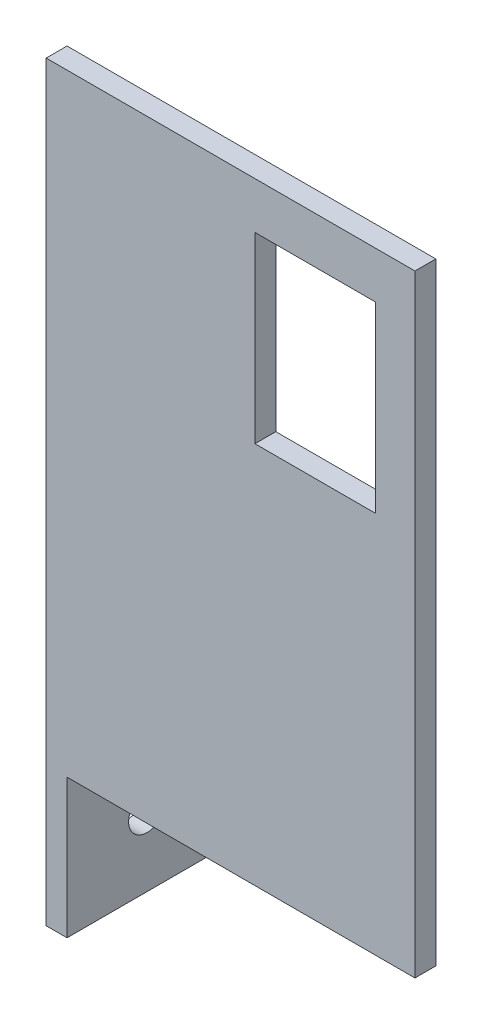
ISO-10303-21;
HEADER;
FILE_DESCRIPTION(('STEP AP214'),'2;1');
FILE_NAME('part.step','',(''),(''),'','','');
FILE_SCHEMA(('AUTOMOTIVE_DESIGN { 1 0 10303 214 1 1 1 1 }'));
ENDSEC;
DATA;
#1=APPLICATION_CONTEXT('core data for automotive mechanical design processes');
#2=APPLICATION_PROTOCOL_DEFINITION('international standard','automotive_design',2000,#1);
#3=PRODUCT_CONTEXT('',#1,'mechanical');
#4=PRODUCT('Part','Part','',(#3));
#5=PRODUCT_RELATED_PRODUCT_CATEGORY('part','',(#4));
#6=PRODUCT_DEFINITION_FORMATION('','',#4);
#7=PRODUCT_DEFINITION_CONTEXT('part definition',#1,'design');
#8=PRODUCT_DEFINITION('design','',#6,#7);
#9=PRODUCT_DEFINITION_SHAPE('','',#8);
#10=(LENGTH_UNIT() NAMED_UNIT(*) SI_UNIT(.MILLI.,.METRE.));
#11=(NAMED_UNIT(*) PLANE_ANGLE_UNIT() SI_UNIT($,.RADIAN.));
#12=(NAMED_UNIT(*) SI_UNIT($,.STERADIAN.) SOLID_ANGLE_UNIT());
#13=UNCERTAINTY_MEASURE_WITH_UNIT(LENGTH_MEASURE(1.E-05),#10,'distance_accuracy_value','');
#14=(GEOMETRIC_REPRESENTATION_CONTEXT(3) GLOBAL_UNCERTAINTY_ASSIGNED_CONTEXT((#13)) GLOBAL_UNIT_ASSIGNED_CONTEXT((#10,
#11,#12)) REPRESENTATION_CONTEXT('',''));
#15=CARTESIAN_POINT('',(0.,0.,0.));
#16=DIRECTION('',(0.,0.,1.));
#17=DIRECTION('',(1.,0.,0.));
#18=AXIS2_PLACEMENT_3D('',#15,#16,#17);
#19=CARTESIAN_POINT('',(8.36363636363636,3.,-11.3770053475936));
#20=DIRECTION('',(-1.,0.,0.));
#21=DIRECTION('',(0.,0.,1.));
#22=AXIS2_PLACEMENT_3D('',#19,#20,#21);
#23=PLANE('',#22);
#24=DIRECTION('',(0.,1.,0.));
#25=VECTOR('',#24,1.);
#26=CARTESIAN_POINT('',(8.36363636363636,88.,8.62299465240642));
#27=LINE('',#26,#25);
#28=CARTESIAN_POINT('',(8.36363636363636,0.,8.62299465240642));
#29=VERTEX_POINT('',#28);
#30=CARTESIAN_POINT('',(8.36363636363636,3.,8.62299465240641));
#31=VERTEX_POINT('',#30);
#32=EDGE_CURVE('E168',#29,#31,#27,.T.);
#33=ORIENTED_EDGE('',*,*,#32,.F.);
#34=DIRECTION('',(0.,0.,-1.));
#35=VECTOR('',#34,1.);
#36=CARTESIAN_POINT('',(8.36363636363636,0.,-11.3770053475936));
#37=LINE('',#36,#35);
#38=CARTESIAN_POINT('',(8.36363636363636,0.,-11.3770053475936));
#39=VERTEX_POINT('',#38);
#40=EDGE_CURVE('E237',#29,#39,#37,.T.);
#41=ORIENTED_EDGE('',*,*,#40,.T.);
#42=DIRECTION('',(0.,-1.,0.));
#43=VECTOR('',#42,1.);
#44=CARTESIAN_POINT('',(8.36363636363636,3.,-11.3770053475936));
#45=LINE('',#44,#43);
#46=CARTESIAN_POINT('',(8.36363636363636,3.,-11.3770053475936));
#47=VERTEX_POINT('',#46);
#48=EDGE_CURVE('E45',#47,#39,#45,.T.);
#49=ORIENTED_EDGE('',*,*,#48,.F.);
#50=DIRECTION('',(0.,0.,-1.));
#51=VECTOR('',#50,1.);
#52=CARTESIAN_POINT('',(8.36363636363636,3.,-11.3770053475936));
#53=LINE('',#52,#51);
#54=EDGE_CURVE('E230',#31,#47,#53,.T.);
#55=ORIENTED_EDGE('',*,*,#54,.F.);
#56=EDGE_LOOP('',(#33,#41,#49,#55));
#57=FACE_BOUND('',#56,.T.);
#58=ADVANCED_FACE('F37',(#57),#23,.F.);
#59=CARTESIAN_POINT('',(0.,0.,0.));
#60=DIRECTION('',(0.,1.,0.));
#61=DIRECTION('',(0.,0.,1.));
#62=AXIS2_PLACEMENT_3D('',#59,#60,#61);
#63=PLANE('',#62);
#64=CARTESIAN_POINT('',(-1.63636363636364,0.,0.122994652406417));
#65=DIRECTION('',(0.,1.,0.));
#66=DIRECTION('',(0.,0.,1.));
#67=AXIS2_PLACEMENT_3D('',#64,#65,#66);
#68=CIRCLE('',#67,2.65);
#69=CARTESIAN_POINT('',(-1.63636363636364,0.,2.77299465240642));
#70=VERTEX_POINT('',#69);
#71=EDGE_CURVE('E222',#70,#70,#68,.T.);
#72=ORIENTED_EDGE('',*,*,#71,.T.);
#73=EDGE_LOOP('',(#72));
#74=FACE_BOUND('',#73,.T.);
#75=DIRECTION('',(0.,0.,1.));
#76=VECTOR('',#75,1.);
#77=CARTESIAN_POINT('',(-11.6363636363636,0.,-11.3770053475936));
#78=LINE('',#77,#76);
#79=CARTESIAN_POINT('',(-11.6363636363636,0.,-11.3770053475936));
#80=VERTEX_POINT('',#79);
#81=CARTESIAN_POINT('',(-11.6363636363636,0.,11.6229946524064));
#82=VERTEX_POINT('',#81);
#83=EDGE_CURVE('E202',#80,#82,#78,.T.);
#84=ORIENTED_EDGE('',*,*,#83,.F.);
#85=DIRECTION('',(-1.,0.,0.));
#86=VECTOR('',#85,1.);
#87=CARTESIAN_POINT('',(-14.6363636363636,0.,-11.3770053475936));
#88=LINE('',#87,#86);
#89=EDGE_CURVE('E231',#39,#80,#88,.T.);
#90=ORIENTED_EDGE('',*,*,#89,.F.);
#91=ORIENTED_EDGE('',*,*,#40,.F.);
#92=DIRECTION('',(-1.,0.,0.));
#93=VECTOR('',#92,1.);
#94=CARTESIAN_POINT('',(38.3636363636364,0.,8.62299465240641));
#95=LINE('',#94,#93);
#96=CARTESIAN_POINT('',(38.3636363636364,0.,8.62299465240641));
#97=VERTEX_POINT('',#96);
#98=EDGE_CURVE('E180',#97,#29,#95,.T.);
#99=ORIENTED_EDGE('',*,*,#98,.F.);
#100=DIRECTION('',(0.,0.,-1.));
#101=VECTOR('',#100,1.);
#102=CARTESIAN_POINT('',(38.3636363636364,0.,8.62299465240641));
#103=LINE('',#102,#101);
#104=CARTESIAN_POINT('',(38.3636363636364,0.,11.6229946524064));
#105=VERTEX_POINT('',#104);
#106=EDGE_CURVE('E178',#105,#97,#103,.T.);
#107=ORIENTED_EDGE('',*,*,#106,.F.);
#108=DIRECTION('',(1.,0.,0.));
#109=VECTOR('',#108,1.);
#110=CARTESIAN_POINT('',(-14.6363636363636,0.,11.6229946524064));
#111=LINE('',#110,#109);
#112=EDGE_CURVE('E225',#82,#105,#111,.T.);
#113=ORIENTED_EDGE('',*,*,#112,.F.);
#114=EDGE_LOOP('',(#84,#90,#91,#99,#107,#113));
#115=FACE_BOUND('',#114,.T.);
#116=ADVANCED_FACE('F253',(#74,#115),#63,.F.);
#117=CARTESIAN_POINT('',(-14.6363636363636,3.,-11.3770053475936));
#118=DIRECTION('',(1.,0.,0.));
#119=DIRECTION('',(0.,0.,-1.));
#120=AXIS2_PLACEMENT_3D('',#117,#118,#119);
#121=PLANE('',#120);
#122=CARTESIAN_POINT('',(-14.6363636363636,-10.,0.122994652406417));
#123=DIRECTION('',(1.,0.,0.));
#124=DIRECTION('',(0.,0.,-1.));
#125=AXIS2_PLACEMENT_3D('',#122,#123,#124);
#126=CIRCLE('',#125,2.65);
#127=CARTESIAN_POINT('',(-14.6363636363636,-10.,-2.52700534759358));
#128=VERTEX_POINT('',#127);
#129=EDGE_CURVE('E199',#128,#128,#126,.T.);
#130=ORIENTED_EDGE('',*,*,#129,.T.);
#131=EDGE_LOOP('',(#130));
#132=FACE_BOUND('',#131,.T.);
#133=DIRECTION('',(0.,-1.,0.));
#134=VECTOR('',#133,1.);
#135=CARTESIAN_POINT('',(-14.6363636363636,3.,-11.3770053475936));
#136=LINE('',#135,#134);
#137=CARTESIAN_POINT('',(-14.6363636363636,3.,-11.3770053475936));
#138=VERTEX_POINT('',#137);
#139=CARTESIAN_POINT('',(-14.6363636363636,-20.,-11.3770053475936));
#140=VERTEX_POINT('',#139);
#141=EDGE_CURVE('E235',#138,#140,#136,.T.);
#142=ORIENTED_EDGE('',*,*,#141,.T.);
#143=DIRECTION('',(0.,0.,-1.));
#144=VECTOR('',#143,1.);
#145=CARTESIAN_POINT('',(-14.6363636363636,-20.,-11.3770053475936));
#146=LINE('',#145,#144);
#147=CARTESIAN_POINT('',(-14.6363636363636,-20.,11.6229946524064));
#148=VERTEX_POINT('',#147);
#149=EDGE_CURVE('E203',#148,#140,#146,.T.);
#150=ORIENTED_EDGE('',*,*,#149,.F.);
#151=DIRECTION('',(0.,-1.,0.));
#152=VECTOR('',#151,1.);
#153=CARTESIAN_POINT('',(-14.6363636363636,3.,11.6229946524064));
#154=LINE('',#153,#152);
#155=CARTESIAN_POINT('',(-14.6363636363636,88.,11.6229946524064));
#156=VERTEX_POINT('',#155);
#157=EDGE_CURVE('E11',#156,#148,#154,.T.);
#158=ORIENTED_EDGE('',*,*,#157,.F.);
#159=DIRECTION('',(0.,0.,1.));
#160=VECTOR('',#159,1.);
#161=CARTESIAN_POINT('',(-14.6363636363636,88.,11.6229946524064));
#162=LINE('',#161,#160);
#163=CARTESIAN_POINT('',(-14.6363636363636,88.,8.62299465240642));
#164=VERTEX_POINT('',#163);
#165=EDGE_CURVE('E184',#164,#156,#162,.T.);
#166=ORIENTED_EDGE('',*,*,#165,.F.);
#167=DIRECTION('',(0.,-1.,0.));
#168=VECTOR('',#167,1.);
#169=CARTESIAN_POINT('',(-14.6363636363636,88.,8.62299465240642));
#170=LINE('',#169,#168);
#171=CARTESIAN_POINT('',(-14.6363636363636,3.,8.62299465240642));
#172=VERTEX_POINT('',#171);
#173=EDGE_CURVE('E191',#164,#172,#170,.T.);
#174=ORIENTED_EDGE('',*,*,#173,.T.);
#175=DIRECTION('',(0.,0.,1.));
#176=VECTOR('',#175,1.);
#177=CARTESIAN_POINT('',(-14.6363636363636,3.,-11.3770053475936));
#178=LINE('',#177,#176);
#179=EDGE_CURVE('E228',#138,#172,#178,.T.);
#180=ORIENTED_EDGE('',*,*,#179,.F.);
#181=EDGE_LOOP('',(#142,#150,#158,#166,#174,#180));
#182=FACE_BOUND('',#181,.T.);
#183=ADVANCED_FACE('F39',(#132,#182),#121,.F.);
#184=CARTESIAN_POINT('',(-14.6363636363636,3.,11.6229946524064));
#185=DIRECTION('',(0.,0.,-1.));
#186=DIRECTION('',(-1.,0.,0.));
#187=AXIS2_PLACEMENT_3D('',#184,#185,#186);
#188=PLANE('',#187);
#189=DIRECTION('',(-1.,0.,0.));
#190=VECTOR('',#189,1.);
#191=CARTESIAN_POINT('',(-14.6363636363636,55.,11.6229946524064));
#192=LINE('',#191,#190);
#193=CARTESIAN_POINT('',(32.6636363636364,55.,11.6229946524064));
#194=VERTEX_POINT('',#193);
#195=CARTESIAN_POINT('',(15.3636363636364,55.,11.6229946524064));
#196=VERTEX_POINT('',#195);
#197=EDGE_CURVE('E162',#194,#196,#192,.T.);
#198=ORIENTED_EDGE('',*,*,#197,.T.);
#199=DIRECTION('',(0.,1.,0.));
#200=VECTOR('',#199,1.);
#201=CARTESIAN_POINT('',(15.3636363636364,3.,11.6229946524064));
#202=LINE('',#201,#200);
#203=CARTESIAN_POINT('',(15.3636363636364,81.3,11.6229946524064));
#204=VERTEX_POINT('',#203);
#205=EDGE_CURVE('E165',#196,#204,#202,.T.);
#206=ORIENTED_EDGE('',*,*,#205,.T.);
#207=DIRECTION('',(1.,0.,0.));
#208=VECTOR('',#207,1.);
#209=CARTESIAN_POINT('',(-14.6363636363636,81.3,11.6229946524064));
#210=LINE('',#209,#208);
#211=CARTESIAN_POINT('',(32.6636363636363,81.3,11.6229946524064));
#212=VERTEX_POINT('',#211);
#213=EDGE_CURVE('E157',#204,#212,#210,.T.);
#214=ORIENTED_EDGE('',*,*,#213,.T.);
#215=DIRECTION('',(0.,-1.,0.));
#216=VECTOR('',#215,1.);
#217=CARTESIAN_POINT('',(32.6636363636363,3.,11.6229946524064));
#218=LINE('',#217,#216);
#219=EDGE_CURVE('E137',#212,#194,#218,.T.);
#220=ORIENTED_EDGE('',*,*,#219,.T.);
#221=EDGE_LOOP('',(#198,#206,#214,#220));
#222=FACE_BOUND('',#221,.T.);
#223=ORIENTED_EDGE('',*,*,#157,.T.);
#224=DIRECTION('',(-1.,0.,0.));
#225=VECTOR('',#224,1.);
#226=CARTESIAN_POINT('',(-14.6363636363636,-20.,11.6229946524064));
#227=LINE('',#226,#225);
#228=CARTESIAN_POINT('',(-11.6363636363636,-20.,11.6229946524064));
#229=VERTEX_POINT('',#228);
#230=EDGE_CURVE('E210',#229,#148,#227,.T.);
#231=ORIENTED_EDGE('',*,*,#230,.F.);
#232=DIRECTION('',(0.,1.,0.));
#233=VECTOR('',#232,1.);
#234=CARTESIAN_POINT('',(-11.6363636363636,-20.,11.6229946524064));
#235=LINE('',#234,#233);
#236=EDGE_CURVE('E213',#229,#82,#235,.T.);
#237=ORIENTED_EDGE('',*,*,#236,.T.);
#238=ORIENTED_EDGE('',*,*,#112,.T.);
#239=DIRECTION('',(0.,-1.,0.));
#240=VECTOR('',#239,1.);
#241=CARTESIAN_POINT('',(38.3636363636364,88.,11.6229946524064));
#242=LINE('',#241,#240);
#243=CARTESIAN_POINT('',(38.3636363636364,88.,11.6229946524064));
#244=VERTEX_POINT('',#243);
#245=EDGE_CURVE('E175',#244,#105,#242,.T.);
#246=ORIENTED_EDGE('',*,*,#245,.F.);
#247=DIRECTION('',(1.,0.,0.));
#248=VECTOR('',#247,1.);
#249=CARTESIAN_POINT('',(-14.6363636363636,88.,11.6229946524064));
#250=LINE('',#249,#248);
#251=EDGE_CURVE('E187',#156,#244,#250,.T.);
#252=ORIENTED_EDGE('',*,*,#251,.F.);
#253=EDGE_LOOP('',(#223,#231,#237,#238,#246,#252));
#254=FACE_BOUND('',#253,.T.);
#255=ADVANCED_FACE('F262',(#222,#254),#188,.F.);
#256=CARTESIAN_POINT('',(-14.6363636363636,3.,-11.3770053475936));
#257=DIRECTION('',(0.,0.,1.));
#258=DIRECTION('',(1.,0.,0.));
#259=AXIS2_PLACEMENT_3D('',#256,#257,#258);
#260=PLANE('',#259);
#261=ORIENTED_EDGE('',*,*,#89,.T.);
#262=DIRECTION('',(0.,1.,0.));
#263=VECTOR('',#262,1.);
#264=CARTESIAN_POINT('',(-11.6363636363636,-20.,-11.3770053475936));
#265=LINE('',#264,#263);
#266=CARTESIAN_POINT('',(-11.6363636363636,-20.,-11.3770053475936));
#267=VERTEX_POINT('',#266);
#268=EDGE_CURVE('E218',#267,#80,#265,.T.);
#269=ORIENTED_EDGE('',*,*,#268,.F.);
#270=DIRECTION('',(1.,0.,0.));
#271=VECTOR('',#270,1.);
#272=CARTESIAN_POINT('',(-14.6363636363636,-20.,-11.3770053475936));
#273=LINE('',#272,#271);
#274=EDGE_CURVE('E206',#140,#267,#273,.T.);
#275=ORIENTED_EDGE('',*,*,#274,.F.);
#276=ORIENTED_EDGE('',*,*,#141,.F.);
#277=DIRECTION('',(-1.,0.,0.));
#278=VECTOR('',#277,1.);
#279=CARTESIAN_POINT('',(-14.6363636363636,3.,-11.3770053475936));
#280=LINE('',#279,#278);
#281=EDGE_CURVE('E233',#47,#138,#280,.T.);
#282=ORIENTED_EDGE('',*,*,#281,.F.);
#283=ORIENTED_EDGE('',*,*,#48,.T.);
#284=EDGE_LOOP('',(#261,#269,#275,#276,#282,#283));
#285=FACE_BOUND('',#284,.T.);
#286=ADVANCED_FACE('F246',(#285),#260,.F.);
#287=CARTESIAN_POINT('',(0.,3.,0.));
#288=DIRECTION('',(0.,1.,0.));
#289=DIRECTION('',(0.,0.,1.));
#290=AXIS2_PLACEMENT_3D('',#287,#288,#289);
#291=PLANE('',#290);
#292=DIRECTION('',(-1.,0.,0.));
#293=VECTOR('',#292,1.);
#294=CARTESIAN_POINT('',(-14.6363636363636,3.,8.62299465240642));
#295=LINE('',#294,#293);
#296=EDGE_CURVE('E183',#31,#172,#295,.T.);
#297=ORIENTED_EDGE('',*,*,#296,.F.);
#298=ORIENTED_EDGE('',*,*,#54,.T.);
#299=ORIENTED_EDGE('',*,*,#281,.T.);
#300=ORIENTED_EDGE('',*,*,#179,.T.);
#301=EDGE_LOOP('',(#297,#298,#299,#300));
#302=FACE_BOUND('',#301,.T.);
#303=CARTESIAN_POINT('',(-1.63636363636364,3.,0.122994652406417));
#304=DIRECTION('',(0.,1.,0.));
#305=DIRECTION('',(0.,0.,1.));
#306=AXIS2_PLACEMENT_3D('',#303,#304,#305);
#307=CIRCLE('',#306,2.65);
#308=CARTESIAN_POINT('',(-1.63636363636364,3.,2.77299465240642));
#309=VERTEX_POINT('',#308);
#310=EDGE_CURVE('E221',#309,#309,#307,.T.);
#311=ORIENTED_EDGE('',*,*,#310,.F.);
#312=EDGE_LOOP('',(#311));
#313=FACE_BOUND('',#312,.T.);
#314=ADVANCED_FACE('F275',(#302,#313),#291,.T.);
#315=CARTESIAN_POINT('',(-1.63636363636364,0.,0.122994652406417));
#316=DIRECTION('',(0.,1.,0.));
#317=DIRECTION('',(0.,0.,1.));
#318=AXIS2_PLACEMENT_3D('',#315,#316,#317);
#319=CYLINDRICAL_SURFACE('',#318,2.65);
#320=ORIENTED_EDGE('',*,*,#71,.F.);
#321=EDGE_LOOP('',(#320));
#322=FACE_BOUND('',#321,.T.);
#323=ORIENTED_EDGE('',*,*,#310,.T.);
#324=EDGE_LOOP('',(#323));
#325=FACE_BOUND('',#324,.T.);
#326=ADVANCED_FACE('F325',(#322,#325),#319,.F.);
#327=CARTESIAN_POINT('',(-11.6363636363636,-20.,-11.3770053475936));
#328=DIRECTION('',(-1.,0.,0.));
#329=DIRECTION('',(0.,0.,1.));
#330=AXIS2_PLACEMENT_3D('',#327,#328,#329);
#331=PLANE('',#330);
#332=CARTESIAN_POINT('',(-11.6363636363636,-10.,0.122994652406417));
#333=DIRECTION('',(1.,0.,0.));
#334=DIRECTION('',(0.,0.,-1.));
#335=AXIS2_PLACEMENT_3D('',#332,#333,#334);
#336=CIRCLE('',#335,2.65);
#337=CARTESIAN_POINT('',(-11.6363636363636,-10.,-2.52700534759358));
#338=VERTEX_POINT('',#337);
#339=EDGE_CURVE('E196',#338,#338,#336,.T.);
#340=ORIENTED_EDGE('',*,*,#339,.F.);
#341=EDGE_LOOP('',(#340));
#342=FACE_BOUND('',#341,.T.);
#343=ORIENTED_EDGE('',*,*,#83,.T.);
#344=ORIENTED_EDGE('',*,*,#236,.F.);
#345=DIRECTION('',(0.,0.,1.));
#346=VECTOR('',#345,1.);
#347=CARTESIAN_POINT('',(-11.6363636363636,-20.,-11.3770053475936));
#348=LINE('',#347,#346);
#349=EDGE_CURVE('E208',#267,#229,#348,.T.);
#350=ORIENTED_EDGE('',*,*,#349,.F.);
#351=ORIENTED_EDGE('',*,*,#268,.T.);
#352=EDGE_LOOP('',(#343,#344,#350,#351));
#353=FACE_BOUND('',#352,.T.);
#354=ADVANCED_FACE('F258',(#342,#353),#331,.F.);
#355=CARTESIAN_POINT('',(0.,-20.,0.));
#356=DIRECTION('',(0.,1.,0.));
#357=DIRECTION('',(0.,0.,1.));
#358=AXIS2_PLACEMENT_3D('',#355,#356,#357);
#359=PLANE('',#358);
#360=ORIENTED_EDGE('',*,*,#149,.T.);
#361=ORIENTED_EDGE('',*,*,#274,.T.);
#362=ORIENTED_EDGE('',*,*,#349,.T.);
#363=ORIENTED_EDGE('',*,*,#230,.T.);
#364=EDGE_LOOP('',(#360,#361,#362,#363));
#365=FACE_BOUND('',#364,.T.);
#366=ADVANCED_FACE('F267',(#365),#359,.F.);
#367=CARTESIAN_POINT('',(-31.6363636363636,-10.,0.122994652406417));
#368=DIRECTION('',(1.,0.,0.));
#369=DIRECTION('',(0.,0.,-1.));
#370=AXIS2_PLACEMENT_3D('',#367,#368,#369);
#371=CYLINDRICAL_SURFACE('',#370,2.65);
#372=ORIENTED_EDGE('',*,*,#339,.T.);
#373=EDGE_LOOP('',(#372));
#374=FACE_BOUND('',#373,.T.);
#375=ORIENTED_EDGE('',*,*,#129,.F.);
#376=EDGE_LOOP('',(#375));
#377=FACE_BOUND('',#376,.T.);
#378=ADVANCED_FACE('F317',(#374,#377),#371,.F.);
#379=CARTESIAN_POINT('',(-14.6363636363636,88.,8.62299465240642));
#380=DIRECTION('',(0.,0.,1.));
#381=DIRECTION('',(1.,0.,0.));
#382=AXIS2_PLACEMENT_3D('',#379,#380,#381);
#383=PLANE('',#382);
#384=DIRECTION('',(1.,0.,0.));
#385=VECTOR('',#384,1.);
#386=CARTESIAN_POINT('',(15.3636363636364,81.3,8.62299465240642));
#387=LINE('',#386,#385);
#388=CARTESIAN_POINT('',(15.3636363636364,81.3,8.62299465240642));
#389=VERTEX_POINT('',#388);
#390=CARTESIAN_POINT('',(32.6636363636364,81.3,8.62299465240642));
#391=VERTEX_POINT('',#390);
#392=EDGE_CURVE('E143',#389,#391,#387,.T.);
#393=ORIENTED_EDGE('',*,*,#392,.F.);
#394=DIRECTION('',(0.,1.,0.));
#395=VECTOR('',#394,1.);
#396=CARTESIAN_POINT('',(15.3636363636364,81.3,8.62299465240642));
#397=LINE('',#396,#395);
#398=CARTESIAN_POINT('',(15.3636363636364,55.,8.62299465240642));
#399=VERTEX_POINT('',#398);
#400=EDGE_CURVE('E60',#399,#389,#397,.T.);
#401=ORIENTED_EDGE('',*,*,#400,.F.);
#402=DIRECTION('',(-1.,0.,0.));
#403=VECTOR('',#402,1.);
#404=CARTESIAN_POINT('',(15.3636363636364,55.,8.62299465240642));
#405=LINE('',#404,#403);
#406=CARTESIAN_POINT('',(32.6636363636364,55.,8.62299465240642));
#407=VERTEX_POINT('',#406);
#408=EDGE_CURVE('E150',#407,#399,#405,.T.);
#409=ORIENTED_EDGE('',*,*,#408,.F.);
#410=DIRECTION('',(0.,-1.,0.));
#411=VECTOR('',#410,1.);
#412=CARTESIAN_POINT('',(32.6636363636364,81.3,8.62299465240642));
#413=LINE('',#412,#411);
#414=EDGE_CURVE('E134',#391,#407,#413,.T.);
#415=ORIENTED_EDGE('',*,*,#414,.F.);
#416=EDGE_LOOP('',(#393,#401,#409,#415));
#417=FACE_BOUND('',#416,.T.);
#418=ORIENTED_EDGE('',*,*,#296,.T.);
#419=ORIENTED_EDGE('',*,*,#173,.F.);
#420=DIRECTION('',(-1.,0.,0.));
#421=VECTOR('',#420,1.);
#422=CARTESIAN_POINT('',(-14.6363636363636,88.,8.62299465240642));
#423=LINE('',#422,#421);
#424=CARTESIAN_POINT('',(38.3636363636364,88.,8.62299465240641));
#425=VERTEX_POINT('',#424);
#426=EDGE_CURVE('E189',#425,#164,#423,.T.);
#427=ORIENTED_EDGE('',*,*,#426,.F.);
#428=DIRECTION('',(0.,1.,0.));
#429=VECTOR('',#428,1.);
#430=CARTESIAN_POINT('',(38.3636363636364,88.,8.62299465240641));
#431=LINE('',#430,#429);
#432=EDGE_CURVE('E169',#97,#425,#431,.T.);
#433=ORIENTED_EDGE('',*,*,#432,.F.);
#434=ORIENTED_EDGE('',*,*,#98,.T.);
#435=ORIENTED_EDGE('',*,*,#32,.T.);
#436=EDGE_LOOP('',(#418,#419,#427,#433,#434,#435));
#437=FACE_BOUND('',#436,.T.);
#438=ADVANCED_FACE('F147',(#417,#437),#383,.F.);
#439=CARTESIAN_POINT('',(0.,88.,0.));
#440=DIRECTION('',(0.,-1.,0.));
#441=DIRECTION('',(0.,0.,-1.));
#442=AXIS2_PLACEMENT_3D('',#439,#440,#441);
#443=PLANE('',#442);
#444=ORIENTED_EDGE('',*,*,#165,.T.);
#445=ORIENTED_EDGE('',*,*,#251,.T.);
#446=DIRECTION('',(0.,0.,1.));
#447=VECTOR('',#446,1.);
#448=CARTESIAN_POINT('',(38.3636363636364,88.,8.62299465240641));
#449=LINE('',#448,#447);
#450=EDGE_CURVE('E172',#425,#244,#449,.T.);
#451=ORIENTED_EDGE('',*,*,#450,.F.);
#452=ORIENTED_EDGE('',*,*,#426,.T.);
#453=EDGE_LOOP('',(#444,#445,#451,#452));
#454=FACE_BOUND('',#453,.T.);
#455=ADVANCED_FACE('F307',(#454),#443,.F.);
#456=CARTESIAN_POINT('',(38.3636363636364,0.,0.));
#457=DIRECTION('',(-1.,0.,0.));
#458=DIRECTION('',(0.,0.,1.));
#459=AXIS2_PLACEMENT_3D('',#456,#457,#458);
#460=PLANE('',#459);
#461=ORIENTED_EDGE('',*,*,#432,.T.);
#462=ORIENTED_EDGE('',*,*,#450,.T.);
#463=ORIENTED_EDGE('',*,*,#245,.T.);
#464=ORIENTED_EDGE('',*,*,#106,.T.);
#465=EDGE_LOOP('',(#461,#462,#463,#464));
#466=FACE_BOUND('',#465,.T.);
#467=ADVANCED_FACE('F301',(#466),#460,.F.);
#468=CARTESIAN_POINT('',(15.3636363636364,81.3,28.6229946524064));
#469=DIRECTION('',(-1.,0.,0.));
#470=DIRECTION('',(0.,0.,1.));
#471=AXIS2_PLACEMENT_3D('',#468,#469,#470);
#472=PLANE('',#471);
#473=DIRECTION('',(0.,0.,-1.));
#474=VECTOR('',#473,1.);
#475=CARTESIAN_POINT('',(15.3636363636364,55.,28.6229946524064));
#476=LINE('',#475,#474);
#477=EDGE_CURVE('E155',#196,#399,#476,.T.);
#478=ORIENTED_EDGE('',*,*,#477,.T.);
#479=ORIENTED_EDGE('',*,*,#400,.T.);
#480=DIRECTION('',(0.,0.,-1.));
#481=VECTOR('',#480,1.);
#482=CARTESIAN_POINT('',(15.3636363636364,81.3,28.6229946524064));
#483=LINE('',#482,#481);
#484=EDGE_CURVE('E140',#204,#389,#483,.T.);
#485=ORIENTED_EDGE('',*,*,#484,.F.);
#486=ORIENTED_EDGE('',*,*,#205,.F.);
#487=EDGE_LOOP('',(#478,#479,#485,#486));
#488=FACE_BOUND('',#487,.T.);
#489=ADVANCED_FACE('F299',(#488),#472,.F.);
#490=CARTESIAN_POINT('',(15.3636363636364,55.,28.6229946524064));
#491=DIRECTION('',(0.,-1.,0.));
#492=DIRECTION('',(0.,0.,-1.));
#493=AXIS2_PLACEMENT_3D('',#490,#491,#492);
#494=PLANE('',#493);
#495=DIRECTION('',(0.,0.,-1.));
#496=VECTOR('',#495,1.);
#497=CARTESIAN_POINT('',(32.6636363636364,55.,28.6229946524064));
#498=LINE('',#497,#496);
#499=EDGE_CURVE('E139',#194,#407,#498,.T.);
#500=ORIENTED_EDGE('',*,*,#499,.T.);
#501=ORIENTED_EDGE('',*,*,#408,.T.);
#502=ORIENTED_EDGE('',*,*,#477,.F.);
#503=ORIENTED_EDGE('',*,*,#197,.F.);
#504=EDGE_LOOP('',(#500,#501,#502,#503));
#505=FACE_BOUND('',#504,.T.);
#506=ADVANCED_FACE('F298',(#505),#494,.F.);
#507=CARTESIAN_POINT('',(32.6636363636364,81.3,28.6229946524064));
#508=DIRECTION('',(1.,0.,0.));
#509=DIRECTION('',(0.,0.,-1.));
#510=AXIS2_PLACEMENT_3D('',#507,#508,#509);
#511=PLANE('',#510);
#512=DIRECTION('',(0.,0.,-1.));
#513=VECTOR('',#512,1.);
#514=CARTESIAN_POINT('',(32.6636363636364,81.3,28.6229946524064));
#515=LINE('',#514,#513);
#516=EDGE_CURVE('E52',#212,#391,#515,.T.);
#517=ORIENTED_EDGE('',*,*,#516,.T.);
#518=ORIENTED_EDGE('',*,*,#414,.T.);
#519=ORIENTED_EDGE('',*,*,#499,.F.);
#520=ORIENTED_EDGE('',*,*,#219,.F.);
#521=EDGE_LOOP('',(#517,#518,#519,#520));
#522=FACE_BOUND('',#521,.T.);
#523=ADVANCED_FACE('F131',(#522),#511,.F.);
#524=CARTESIAN_POINT('',(15.3636363636364,81.3,28.6229946524064));
#525=DIRECTION('',(0.,1.,0.));
#526=DIRECTION('',(0.,0.,1.));
#527=AXIS2_PLACEMENT_3D('',#524,#525,#526);
#528=PLANE('',#527);
#529=ORIENTED_EDGE('',*,*,#484,.T.);
#530=ORIENTED_EDGE('',*,*,#392,.T.);
#531=ORIENTED_EDGE('',*,*,#516,.F.);
#532=ORIENTED_EDGE('',*,*,#213,.F.);
#533=EDGE_LOOP('',(#529,#530,#531,#532));
#534=FACE_BOUND('',#533,.T.);
#535=ADVANCED_FACE('F144',(#534),#528,.F.);
#536=CLOSED_SHELL('',(#58,#116,#183,#255,#286,#314,#326,#354,#366,#378,#438,#455,#467,#489,#506,
#523,#535));
#537=MANIFOLD_SOLID_BREP('B2',#536);
#538=ADVANCED_BREP_SHAPE_REPRESENTATION('',(#18,#537),#14);
#539=SHAPE_DEFINITION_REPRESENTATION(#9,#538);
ENDSEC;
END-ISO-10303-21;
